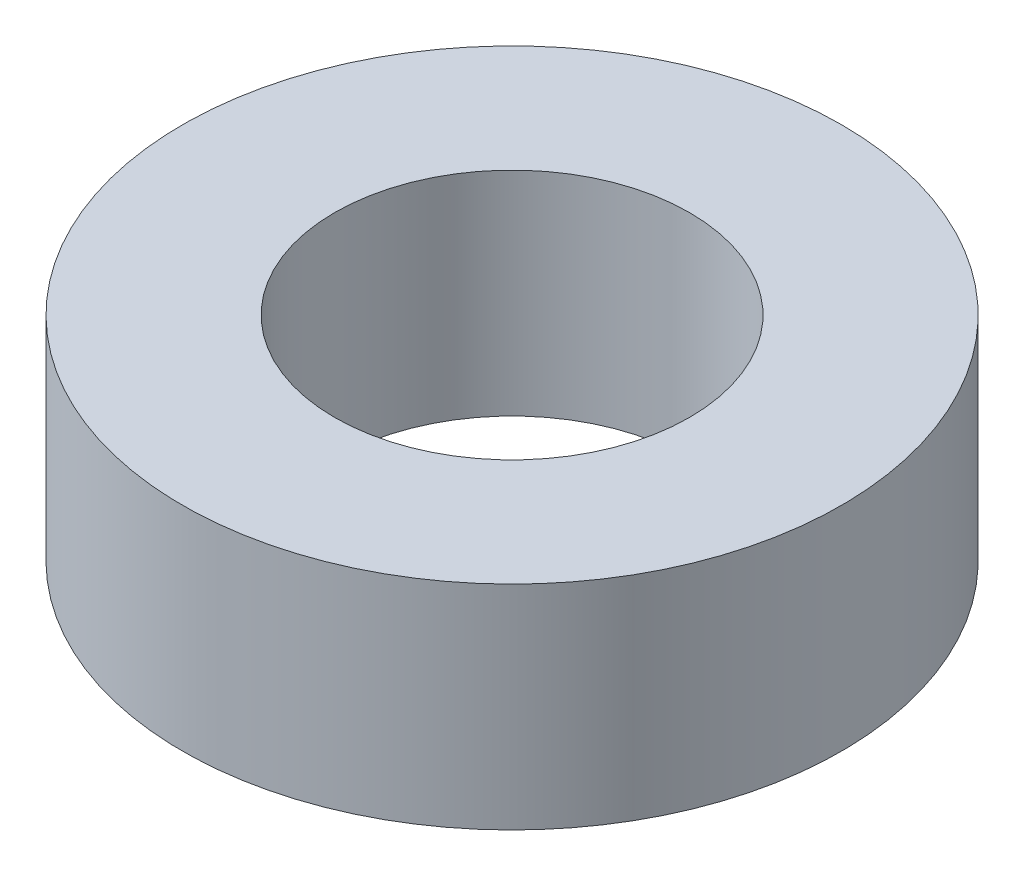
ISO-10303-21;
HEADER;
FILE_DESCRIPTION(('STEP AP214'),'2;1');
FILE_NAME('part.step','',(''),(''),'','','');
FILE_SCHEMA(('AUTOMOTIVE_DESIGN { 1 0 10303 214 1 1 1 1 }'));
ENDSEC;
DATA;
#1=APPLICATION_CONTEXT('core data for automotive mechanical design processes');
#2=APPLICATION_PROTOCOL_DEFINITION('international standard','automotive_design',2000,#1);
#3=PRODUCT_CONTEXT('',#1,'mechanical');
#4=PRODUCT('Part','Part','',(#3));
#5=PRODUCT_RELATED_PRODUCT_CATEGORY('part','',(#4));
#6=PRODUCT_DEFINITION_FORMATION('','',#4);
#7=PRODUCT_DEFINITION_CONTEXT('part definition',#1,'design');
#8=PRODUCT_DEFINITION('design','',#6,#7);
#9=PRODUCT_DEFINITION_SHAPE('','',#8);
#10=(LENGTH_UNIT() NAMED_UNIT(*) SI_UNIT(.MILLI.,.METRE.));
#11=(NAMED_UNIT(*) PLANE_ANGLE_UNIT() SI_UNIT($,.RADIAN.));
#12=(NAMED_UNIT(*) SI_UNIT($,.STERADIAN.) SOLID_ANGLE_UNIT());
#13=UNCERTAINTY_MEASURE_WITH_UNIT(LENGTH_MEASURE(1.E-05),#10,'distance_accuracy_value','');
#14=(GEOMETRIC_REPRESENTATION_CONTEXT(3) GLOBAL_UNCERTAINTY_ASSIGNED_CONTEXT((#13)) GLOBAL_UNIT_ASSIGNED_CONTEXT((#10,
#11,#12)) REPRESENTATION_CONTEXT('',''));
#15=CARTESIAN_POINT('',(0.,0.,0.));
#16=DIRECTION('',(0.,0.,1.));
#17=DIRECTION('',(1.,0.,0.));
#18=AXIS2_PLACEMENT_3D('',#15,#16,#17);
#19=CARTESIAN_POINT('',(0.,21.,0.));
#20=DIRECTION('',(0.,-1.,0.));
#21=DIRECTION('',(0.,0.,-1.));
#22=AXIS2_PLACEMENT_3D('',#19,#20,#21);
#23=CYLINDRICAL_SURFACE('',#22,32.5);
#24=CARTESIAN_POINT('',(0.,21.,0.));
#25=DIRECTION('',(0.,1.,0.));
#26=DIRECTION('',(0.,0.,1.));
#27=AXIS2_PLACEMENT_3D('',#24,#25,#26);
#28=CIRCLE('',#27,32.5);
#29=CARTESIAN_POINT('',(0.,21.,-32.5));
#30=VERTEX_POINT('',#29);
#31=EDGE_CURVE('E10',#30,#30,#28,.T.);
#32=CARTESIAN_POINT('',(0.,0.,0.));
#33=DIRECTION('',(0.,1.,0.));
#34=DIRECTION('',(0.,0.,1.));
#35=AXIS2_PLACEMENT_3D('',#32,#33,#34);
#36=CIRCLE('',#35,32.5);
#37=CARTESIAN_POINT('',(0.,0.,-32.5));
#38=VERTEX_POINT('',#37);
#39=EDGE_CURVE('E37',#38,#38,#36,.T.);
#40=CARTESIAN_POINT('',(0.,21.,-32.5));
#41=CARTESIAN_POINT('',(0.,20.78125,-32.5));
#42=CARTESIAN_POINT('',(0.,20.5625,-32.5));
#43=CARTESIAN_POINT('',(0.,20.125,-32.5));
#44=CARTESIAN_POINT('',(0.,19.90625,-32.5));
#45=CARTESIAN_POINT('',(0.,19.46875,-32.5));
#46=CARTESIAN_POINT('',(0.,19.25,-32.5));
#47=CARTESIAN_POINT('',(0.,18.8125,-32.5));
#48=CARTESIAN_POINT('',(0.,18.59375,-32.5));
#49=CARTESIAN_POINT('',(0.,18.15625,-32.5));
#50=CARTESIAN_POINT('',(0.,17.9375,-32.5));
#51=CARTESIAN_POINT('',(0.,17.5,-32.5));
#52=CARTESIAN_POINT('',(0.,17.28125,-32.5));
#53=CARTESIAN_POINT('',(0.,16.84375,-32.5));
#54=CARTESIAN_POINT('',(0.,16.625,-32.5));
#55=CARTESIAN_POINT('',(0.,16.1875,-32.5));
#56=CARTESIAN_POINT('',(0.,15.96875,-32.5));
#57=CARTESIAN_POINT('',(0.,15.53125,-32.5));
#58=CARTESIAN_POINT('',(0.,15.3125,-32.5));
#59=CARTESIAN_POINT('',(0.,14.875,-32.5));
#60=CARTESIAN_POINT('',(0.,14.65625,-32.5));
#61=CARTESIAN_POINT('',(0.,14.21875,-32.5));
#62=CARTESIAN_POINT('',(0.,14.,-32.5));
#63=CARTESIAN_POINT('',(0.,13.5625,-32.5));
#64=CARTESIAN_POINT('',(0.,13.34375,-32.5));
#65=CARTESIAN_POINT('',(0.,12.90625,-32.5));
#66=CARTESIAN_POINT('',(0.,12.6875,-32.5));
#67=CARTESIAN_POINT('',(0.,12.25,-32.5));
#68=CARTESIAN_POINT('',(0.,12.03125,-32.5));
#69=CARTESIAN_POINT('',(0.,11.59375,-32.5));
#70=CARTESIAN_POINT('',(0.,11.375,-32.5));
#71=CARTESIAN_POINT('',(0.,10.9375,-32.5));
#72=CARTESIAN_POINT('',(0.,10.71875,-32.5));
#73=CARTESIAN_POINT('',(0.,10.28125,-32.5));
#74=CARTESIAN_POINT('',(0.,10.0625,-32.5));
#75=CARTESIAN_POINT('',(0.,9.625,-32.5));
#76=CARTESIAN_POINT('',(0.,9.40625,-32.5));
#77=CARTESIAN_POINT('',(0.,8.96875,-32.5));
#78=CARTESIAN_POINT('',(0.,8.75,-32.5));
#79=CARTESIAN_POINT('',(0.,8.3125,-32.5));
#80=CARTESIAN_POINT('',(0.,8.09375,-32.5));
#81=CARTESIAN_POINT('',(0.,7.65625,-32.5));
#82=CARTESIAN_POINT('',(0.,7.4375,-32.5));
#83=CARTESIAN_POINT('',(0.,7.,-32.5));
#84=CARTESIAN_POINT('',(0.,6.78125,-32.5));
#85=CARTESIAN_POINT('',(0.,6.34375,-32.5));
#86=CARTESIAN_POINT('',(0.,6.125,-32.5));
#87=CARTESIAN_POINT('',(0.,5.6875,-32.5));
#88=CARTESIAN_POINT('',(0.,5.46875,-32.5));
#89=CARTESIAN_POINT('',(0.,5.03125,-32.5));
#90=CARTESIAN_POINT('',(0.,4.8125,-32.5));
#91=CARTESIAN_POINT('',(0.,4.375,-32.5));
#92=CARTESIAN_POINT('',(0.,4.15625,-32.5));
#93=CARTESIAN_POINT('',(0.,3.71875,-32.5));
#94=CARTESIAN_POINT('',(0.,3.5,-32.5));
#95=CARTESIAN_POINT('',(0.,3.0625,-32.5));
#96=CARTESIAN_POINT('',(0.,2.84375,-32.5));
#97=CARTESIAN_POINT('',(0.,2.40625,-32.5));
#98=CARTESIAN_POINT('',(0.,2.1875,-32.5));
#99=CARTESIAN_POINT('',(0.,1.75,-32.5));
#100=CARTESIAN_POINT('',(0.,1.53125,-32.5));
#101=CARTESIAN_POINT('',(0.,1.09375,-32.5));
#102=CARTESIAN_POINT('',(0.,0.875000000000001,-32.5));
#103=CARTESIAN_POINT('',(0.,0.4375,-32.5));
#104=CARTESIAN_POINT('',(0.,0.21875,-32.5));
#105=CARTESIAN_POINT('',(0.,0.,-32.5));
#106=B_SPLINE_CURVE_WITH_KNOTS('',3,(#40,#41,#42,#43,#44,#45,#46,#47,#48,#49,#50,#51,#52,#53,
#54,#55,#56,#57,#58,#59,#60,#61,#62,#63,#64,#65,#66,#67,#68,#69,#70,#71,#72,#73,#74,#75,#76,#77,
#78,#79,#80,#81,#82,#83,#84,#85,#86,#87,#88,#89,#90,#91,#92,#93,#94,#95,#96,#97,#98,#99,#100,
#101,#102,#103,#104,#105),.UNSPECIFIED.,.F.,.F.,(4,2,2,2,2,2,2,2,2,2,2,2,2,2,2,2,2,2,2,2,2,2,2,
2,2,2,2,2,2,2,2,2,4),(0.,0.656249999999997,1.3125,1.96875,2.625,3.28125,3.9375,4.59375,5.25,
5.90625,6.5625,7.21875,7.875,8.53125,9.1875,9.84375,10.5,11.15625,11.8125,12.46875,13.125,
13.78125,14.4375,15.09375,15.75,16.40625,17.0625,17.71875,18.375,19.03125,19.6875,20.34375,21.),.UNSPECIFIED.);
#107=EDGE_CURVE('BSEAM40',#30,#38,#106,.T.);
#108=ORIENTED_EDGE('',*,*,#31,.F.);
#109=ORIENTED_EDGE('',*,*,#39,.T.);
#110=ORIENTED_EDGE('',*,*,#107,.T.);
#111=ORIENTED_EDGE('',*,*,#107,.F.);
#112=EDGE_LOOP('',(#108,#110,#109,#111));
#113=FACE_BOUND('',#112,.T.);
#114=ADVANCED_FACE('F40',(#113),#23,.T.);
#115=CARTESIAN_POINT('',(0.,21.,0.));
#116=DIRECTION('',(0.,1.,0.));
#117=DIRECTION('',(0.,0.,1.));
#118=AXIS2_PLACEMENT_3D('',#115,#116,#117);
#119=PLANE('',#118);
#120=CARTESIAN_POINT('',(0.,21.,0.));
#121=DIRECTION('',(0.,1.,0.));
#122=DIRECTION('',(0.,0.,1.));
#123=AXIS2_PLACEMENT_3D('',#120,#121,#122);
#124=CIRCLE('',#123,17.5);
#125=CARTESIAN_POINT('',(0.,21.,-17.5));
#126=VERTEX_POINT('',#125);
#127=EDGE_CURVE('E50',#126,#126,#124,.T.);
#128=ORIENTED_EDGE('',*,*,#127,.F.);
#129=EDGE_LOOP('',(#128));
#130=FACE_BOUND('',#129,.T.);
#131=ORIENTED_EDGE('',*,*,#31,.T.);
#132=EDGE_LOOP('',(#131));
#133=FACE_BOUND('',#132,.T.);
#134=ADVANCED_FACE('F59',(#130,#133),#119,.T.);
#135=CARTESIAN_POINT('',(0.,0.,0.));
#136=DIRECTION('',(0.,1.,0.));
#137=DIRECTION('',(0.,0.,1.));
#138=AXIS2_PLACEMENT_3D('',#135,#136,#137);
#139=PLANE('',#138);
#140=CARTESIAN_POINT('',(0.,0.,0.));
#141=DIRECTION('',(0.,1.,0.));
#142=DIRECTION('',(0.,0.,1.));
#143=AXIS2_PLACEMENT_3D('',#140,#141,#142);
#144=CIRCLE('',#143,17.5);
#145=CARTESIAN_POINT('',(0.,0.,-17.5));
#146=VERTEX_POINT('',#145);
#147=EDGE_CURVE('E47',#146,#146,#144,.T.);
#148=ORIENTED_EDGE('',*,*,#147,.T.);
#149=EDGE_LOOP('',(#148));
#150=FACE_BOUND('',#149,.T.);
#151=ORIENTED_EDGE('',*,*,#39,.F.);
#152=EDGE_LOOP('',(#151));
#153=FACE_BOUND('',#152,.T.);
#154=ADVANCED_FACE('F58',(#150,#153),#139,.F.);
#155=CARTESIAN_POINT('',(0.,21.,0.));
#156=DIRECTION('',(0.,-1.,0.));
#157=DIRECTION('',(0.,0.,-1.));
#158=AXIS2_PLACEMENT_3D('',#155,#156,#157);
#159=CYLINDRICAL_SURFACE('',#158,17.5);
#160=CARTESIAN_POINT('',(0.,21.,-17.5));
#161=CARTESIAN_POINT('',(0.,20.78125,-17.5));
#162=CARTESIAN_POINT('',(0.,20.5625,-17.5));
#163=CARTESIAN_POINT('',(0.,20.125,-17.5));
#164=CARTESIAN_POINT('',(0.,19.90625,-17.5));
#165=CARTESIAN_POINT('',(0.,19.46875,-17.5));
#166=CARTESIAN_POINT('',(0.,19.25,-17.5));
#167=CARTESIAN_POINT('',(0.,18.8125,-17.5));
#168=CARTESIAN_POINT('',(0.,18.59375,-17.5));
#169=CARTESIAN_POINT('',(0.,18.15625,-17.5));
#170=CARTESIAN_POINT('',(0.,17.9375,-17.5));
#171=CARTESIAN_POINT('',(0.,17.5,-17.5));
#172=CARTESIAN_POINT('',(0.,17.28125,-17.5));
#173=CARTESIAN_POINT('',(0.,16.84375,-17.5));
#174=CARTESIAN_POINT('',(0.,16.625,-17.5));
#175=CARTESIAN_POINT('',(0.,16.1875,-17.5));
#176=CARTESIAN_POINT('',(0.,15.96875,-17.5));
#177=CARTESIAN_POINT('',(0.,15.53125,-17.5));
#178=CARTESIAN_POINT('',(0.,15.3125,-17.5));
#179=CARTESIAN_POINT('',(0.,14.875,-17.5));
#180=CARTESIAN_POINT('',(0.,14.65625,-17.5));
#181=CARTESIAN_POINT('',(0.,14.21875,-17.5));
#182=CARTESIAN_POINT('',(0.,14.,-17.5));
#183=CARTESIAN_POINT('',(0.,13.5625,-17.5));
#184=CARTESIAN_POINT('',(0.,13.34375,-17.5));
#185=CARTESIAN_POINT('',(0.,12.90625,-17.5));
#186=CARTESIAN_POINT('',(0.,12.6875,-17.5));
#187=CARTESIAN_POINT('',(0.,12.25,-17.5));
#188=CARTESIAN_POINT('',(0.,12.03125,-17.5));
#189=CARTESIAN_POINT('',(0.,11.59375,-17.5));
#190=CARTESIAN_POINT('',(0.,11.375,-17.5));
#191=CARTESIAN_POINT('',(0.,10.9375,-17.5));
#192=CARTESIAN_POINT('',(0.,10.71875,-17.5));
#193=CARTESIAN_POINT('',(0.,10.28125,-17.5));
#194=CARTESIAN_POINT('',(0.,10.0625,-17.5));
#195=CARTESIAN_POINT('',(0.,9.625,-17.5));
#196=CARTESIAN_POINT('',(0.,9.40625,-17.5));
#197=CARTESIAN_POINT('',(0.,8.96875,-17.5));
#198=CARTESIAN_POINT('',(0.,8.75,-17.5));
#199=CARTESIAN_POINT('',(0.,8.3125,-17.5));
#200=CARTESIAN_POINT('',(0.,8.09375,-17.5));
#201=CARTESIAN_POINT('',(0.,7.65625,-17.5));
#202=CARTESIAN_POINT('',(0.,7.4375,-17.5));
#203=CARTESIAN_POINT('',(0.,7.,-17.5));
#204=CARTESIAN_POINT('',(0.,6.78125,-17.5));
#205=CARTESIAN_POINT('',(0.,6.34375,-17.5));
#206=CARTESIAN_POINT('',(0.,6.125,-17.5));
#207=CARTESIAN_POINT('',(0.,5.6875,-17.5));
#208=CARTESIAN_POINT('',(0.,5.46875,-17.5));
#209=CARTESIAN_POINT('',(0.,5.03125,-17.5));
#210=CARTESIAN_POINT('',(0.,4.8125,-17.5));
#211=CARTESIAN_POINT('',(0.,4.375,-17.5));
#212=CARTESIAN_POINT('',(0.,4.15625,-17.5));
#213=CARTESIAN_POINT('',(0.,3.71875,-17.5));
#214=CARTESIAN_POINT('',(0.,3.5,-17.5));
#215=CARTESIAN_POINT('',(0.,3.0625,-17.5));
#216=CARTESIAN_POINT('',(0.,2.84375,-17.5));
#217=CARTESIAN_POINT('',(0.,2.40625,-17.5));
#218=CARTESIAN_POINT('',(0.,2.1875,-17.5));
#219=CARTESIAN_POINT('',(0.,1.75,-17.5));
#220=CARTESIAN_POINT('',(0.,1.53125,-17.5));
#221=CARTESIAN_POINT('',(0.,1.09375,-17.5));
#222=CARTESIAN_POINT('',(0.,0.875000000000001,-17.5));
#223=CARTESIAN_POINT('',(0.,0.4375,-17.5));
#224=CARTESIAN_POINT('',(0.,0.21875,-17.5));
#225=CARTESIAN_POINT('',(0.,0.,-17.5));
#226=B_SPLINE_CURVE_WITH_KNOTS('',3,(#160,#161,#162,#163,#164,#165,#166,#167,#168,#169,#170,
#171,#172,#173,#174,#175,#176,#177,#178,#179,#180,#181,#182,#183,#184,#185,#186,#187,#188,#189,
#190,#191,#192,#193,#194,#195,#196,#197,#198,#199,#200,#201,#202,#203,#204,#205,#206,#207,#208,
#209,#210,#211,#212,#213,#214,#215,#216,#217,#218,#219,#220,#221,#222,#223,#224,#225),
.UNSPECIFIED.,.F.,.F.,(4,2,2,2,2,2,2,2,2,2,2,2,2,2,2,2,2,2,2,2,2,2,2,2,2,2,2,2,2,2,2,2,4),(0.,
0.656249999999997,1.3125,1.96875,2.625,3.28125,3.9375,4.59375,5.25,5.90625,6.5625,7.21875,7.875,
8.53125,9.1875,9.84375,10.5,11.15625,11.8125,12.46875,13.125,13.78125,14.4375,15.09375,15.75,
16.40625,17.0625,17.71875,18.375,19.03125,19.6875,20.34375,21.),.UNSPECIFIED.);
#227=EDGE_CURVE('BSEAM54',#126,#146,#226,.T.);
#228=ORIENTED_EDGE('',*,*,#127,.T.);
#229=ORIENTED_EDGE('',*,*,#147,.F.);
#230=ORIENTED_EDGE('',*,*,#227,.T.);
#231=ORIENTED_EDGE('',*,*,#227,.F.);
#232=EDGE_LOOP('',(#228,#230,#229,#231));
#233=FACE_BOUND('',#232,.T.);
#234=ADVANCED_FACE('F54',(#233),#159,.F.);
#235=CLOSED_SHELL('',(#114,#134,#154,#234));
#236=MANIFOLD_SOLID_BREP('B2',#235);
#237=ADVANCED_BREP_SHAPE_REPRESENTATION('',(#18,#236),#14);
#238=SHAPE_DEFINITION_REPRESENTATION(#9,#237);
ENDSEC;
END-ISO-10303-21;
